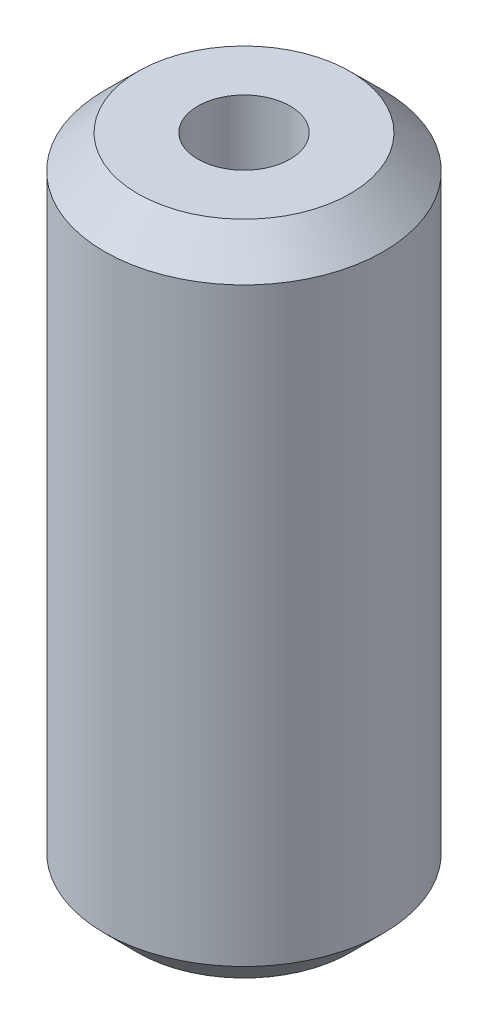
ISO-10303-21;
HEADER;
FILE_DESCRIPTION(('STEP AP214'),'2;1');
FILE_NAME('part.step','',(''),(''),'','','');
FILE_SCHEMA(('AUTOMOTIVE_DESIGN { 1 0 10303 214 1 1 1 1 }'));
ENDSEC;
DATA;
#1=APPLICATION_CONTEXT('core data for automotive mechanical design processes');
#2=APPLICATION_PROTOCOL_DEFINITION('international standard','automotive_design',2000,#1);
#3=PRODUCT_CONTEXT('',#1,'mechanical');
#4=PRODUCT('Part','Part','',(#3));
#5=PRODUCT_RELATED_PRODUCT_CATEGORY('part','',(#4));
#6=PRODUCT_DEFINITION_FORMATION('','',#4);
#7=PRODUCT_DEFINITION_CONTEXT('part definition',#1,'design');
#8=PRODUCT_DEFINITION('design','',#6,#7);
#9=PRODUCT_DEFINITION_SHAPE('','',#8);
#10=(LENGTH_UNIT() NAMED_UNIT(*) SI_UNIT(.MILLI.,.METRE.));
#11=(NAMED_UNIT(*) PLANE_ANGLE_UNIT() SI_UNIT($,.RADIAN.));
#12=(NAMED_UNIT(*) SI_UNIT($,.STERADIAN.) SOLID_ANGLE_UNIT());
#13=UNCERTAINTY_MEASURE_WITH_UNIT(LENGTH_MEASURE(1.E-05),#10,'distance_accuracy_value','');
#14=(GEOMETRIC_REPRESENTATION_CONTEXT(3) GLOBAL_UNCERTAINTY_ASSIGNED_CONTEXT((#13)) GLOBAL_UNIT_ASSIGNED_CONTEXT((#10,
#11,#12)) REPRESENTATION_CONTEXT('',''));
#15=CARTESIAN_POINT('',(0.,0.,0.));
#16=DIRECTION('',(0.,0.,1.));
#17=DIRECTION('',(1.,0.,0.));
#18=AXIS2_PLACEMENT_3D('',#15,#16,#17);
#19=CARTESIAN_POINT('',(0.,23.5379356384627,0.));
#20=DIRECTION('',(0.,-1.,0.));
#21=DIRECTION('',(0.,0.,-1.));
#22=AXIS2_PLACEMENT_3D('',#19,#20,#21);
#23=CYLINDRICAL_SURFACE('',#22,5.);
#24=CARTESIAN_POINT('',(0.,22.3466621349308,0.));
#25=DIRECTION('',(0.,1.,0.));
#26=DIRECTION('',(0.,0.,1.));
#27=AXIS2_PLACEMENT_3D('',#24,#25,#26);
#28=CIRCLE('',#27,5.);
#29=CARTESIAN_POINT('',(0.,22.3466621349308,5.));
#30=VERTEX_POINT('',#29);
#31=EDGE_CURVE('E50',#30,#30,#28,.F.);
#32=ORIENTED_EDGE('',*,*,#31,.T.);
#33=EDGE_LOOP('',(#32));
#34=FACE_BOUND('',#33,.T.);
#35=CARTESIAN_POINT('',(0.,1.20007235864107,0.));
#36=DIRECTION('',(0.,1.,0.));
#37=DIRECTION('',(0.,0.,1.));
#38=AXIS2_PLACEMENT_3D('',#35,#36,#37);
#39=CIRCLE('',#38,5.);
#40=CARTESIAN_POINT('',(0.,1.20007235864107,5.));
#41=VERTEX_POINT('',#40);
#42=EDGE_CURVE('E51',#41,#41,#39,.T.);
#43=ORIENTED_EDGE('',*,*,#42,.T.);
#44=EDGE_LOOP('',(#43));
#45=FACE_BOUND('',#44,.T.);
#46=ADVANCED_FACE('F39',(#34,#45),#23,.T.);
#47=CARTESIAN_POINT('',(0.,23.5379356384627,0.));
#48=DIRECTION('',(0.,1.,0.));
#49=DIRECTION('',(0.,0.,1.));
#50=AXIS2_PLACEMENT_3D('',#47,#48,#49);
#51=PLANE('',#50);
#52=CARTESIAN_POINT('',(0.,23.5379356384627,0.));
#53=DIRECTION('',(0.,1.,0.));
#54=DIRECTION('',(0.,0.,1.));
#55=AXIS2_PLACEMENT_3D('',#52,#53,#54);
#56=CIRCLE('',#55,3.79992764135894);
#57=CARTESIAN_POINT('',(0.,23.5379356384627,3.79992764135894));
#58=VERTEX_POINT('',#57);
#59=EDGE_CURVE('E54',#58,#58,#56,.T.);
#60=ORIENTED_EDGE('',*,*,#59,.T.);
#61=EDGE_LOOP('',(#60));
#62=FACE_BOUND('',#61,.T.);
#63=CARTESIAN_POINT('',(0.,23.5379356384627,0.));
#64=DIRECTION('',(0.,1.,0.));
#65=DIRECTION('',(0.,0.,1.));
#66=AXIS2_PLACEMENT_3D('',#63,#64,#65);
#67=CIRCLE('',#66,1.65198933604606);
#68=CARTESIAN_POINT('',(0.,23.5379356384627,1.65198933604606));
#69=VERTEX_POINT('',#68);
#70=EDGE_CURVE('E58',#69,#69,#67,.T.);
#71=ORIENTED_EDGE('',*,*,#70,.F.);
#72=EDGE_LOOP('',(#71));
#73=FACE_BOUND('',#72,.T.);
#74=ADVANCED_FACE('F69',(#62,#73),#51,.T.);
#75=CARTESIAN_POINT('',(0.,0.,0.));
#76=DIRECTION('',(0.,1.,0.));
#77=DIRECTION('',(0.,0.,1.));
#78=AXIS2_PLACEMENT_3D('',#75,#76,#77);
#79=PLANE('',#78);
#80=CARTESIAN_POINT('',(0.,0.,0.));
#81=DIRECTION('',(0.,1.,0.));
#82=DIRECTION('',(0.,0.,1.));
#83=AXIS2_PLACEMENT_3D('',#80,#81,#82);
#84=CIRCLE('',#83,3.80872649646808);
#85=CARTESIAN_POINT('',(0.,0.,3.80872649646808));
#86=VERTEX_POINT('',#85);
#87=EDGE_CURVE('E10',#86,#86,#84,.F.);
#88=ORIENTED_EDGE('',*,*,#87,.T.);
#89=EDGE_LOOP('',(#88));
#90=FACE_BOUND('',#89,.T.);
#91=CARTESIAN_POINT('',(0.,0.,0.));
#92=DIRECTION('',(0.,1.,0.));
#93=DIRECTION('',(0.,0.,1.));
#94=AXIS2_PLACEMENT_3D('',#91,#92,#93);
#95=CIRCLE('',#94,1.65198933604606);
#96=CARTESIAN_POINT('',(0.,0.,1.65198933604606));
#97=VERTEX_POINT('',#96);
#98=EDGE_CURVE('E63',#97,#97,#95,.T.);
#99=ORIENTED_EDGE('',*,*,#98,.T.);
#100=EDGE_LOOP('',(#99));
#101=FACE_BOUND('',#100,.T.);
#102=ADVANCED_FACE('F75',(#90,#101),#79,.F.);
#103=CARTESIAN_POINT('',(0.,23.5379356384627,0.));
#104=DIRECTION('',(0.,-1.,0.));
#105=DIRECTION('',(0.,0.,-1.));
#106=AXIS2_PLACEMENT_3D('',#103,#104,#105);
#107=CYLINDRICAL_SURFACE('',#106,1.65198933604606);
#108=ORIENTED_EDGE('',*,*,#70,.T.);
#109=EDGE_LOOP('',(#108));
#110=FACE_BOUND('',#109,.T.);
#111=ORIENTED_EDGE('',*,*,#98,.F.);
#112=EDGE_LOOP('',(#111));
#113=FACE_BOUND('',#112,.T.);
#114=ADVANCED_FACE('F70',(#110,#113),#107,.F.);
#115=CARTESIAN_POINT('',(0.,23.5379356384627,0.));
#116=DIRECTION('',(0.,-1.,0.));
#117=DIRECTION('',(0.,0.,-1.));
#118=AXIS2_PLACEMENT_3D('',#115,#116,#117);
#119=CONICAL_SURFACE('',#118,3.79992764135894,0.789077604142999);
#120=ORIENTED_EDGE('',*,*,#31,.F.);
#121=EDGE_LOOP('',(#120));
#122=FACE_BOUND('',#121,.T.);
#123=ORIENTED_EDGE('',*,*,#59,.F.);
#124=EDGE_LOOP('',(#123));
#125=FACE_BOUND('',#124,.T.);
#126=ADVANCED_FACE('F81',(#122,#125),#119,.T.);
#127=CARTESIAN_POINT('',(0.,1.20007235864107,0.));
#128=DIRECTION('',(0.,1.,0.));
#129=DIRECTION('',(0.,0.,1.));
#130=AXIS2_PLACEMENT_3D('',#127,#128,#129);
#131=CONICAL_SURFACE('',#130,5.,0.781718722651897);
#132=ORIENTED_EDGE('',*,*,#87,.F.);
#133=EDGE_LOOP('',(#132));
#134=FACE_BOUND('',#133,.T.);
#135=ORIENTED_EDGE('',*,*,#42,.F.);
#136=EDGE_LOOP('',(#135));
#137=FACE_BOUND('',#136,.T.);
#138=ADVANCED_FACE('F45',(#134,#137),#131,.T.);
#139=CLOSED_SHELL('',(#46,#74,#102,#114,#126,#138));
#140=MANIFOLD_SOLID_BREP('B2',#139);
#141=ADVANCED_BREP_SHAPE_REPRESENTATION('',(#18,#140),#14);
#142=SHAPE_DEFINITION_REPRESENTATION(#9,#141);
ENDSEC;
END-ISO-10303-21;
